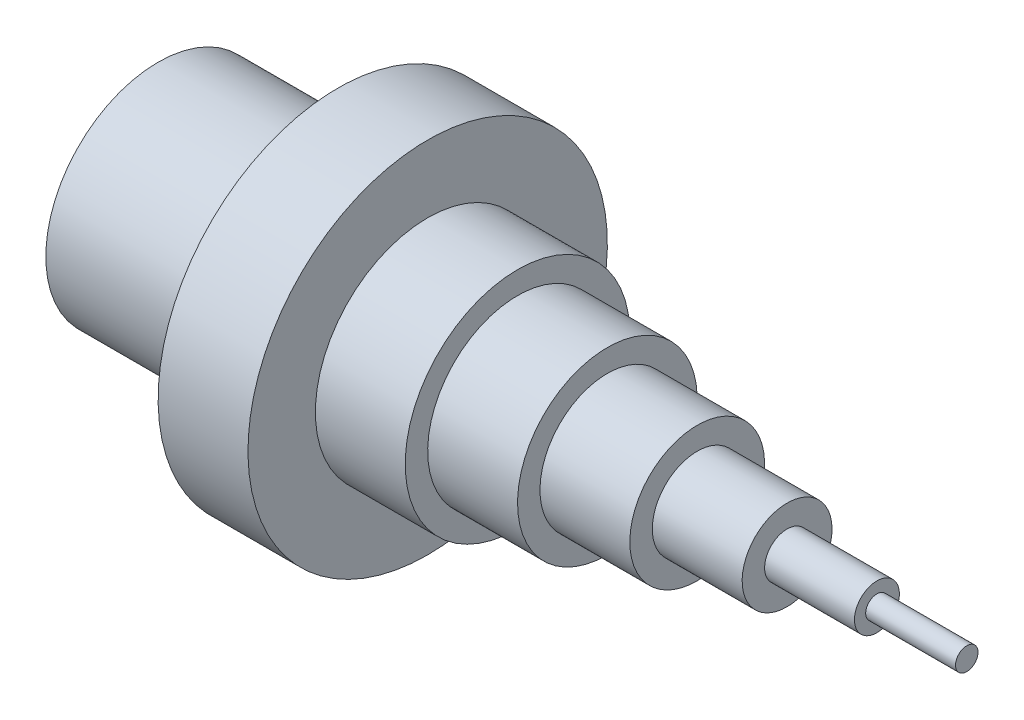
ISO-10303-21;
HEADER;
FILE_DESCRIPTION(('STEP AP214'),'2;1');
FILE_NAME('part.step','',(''),(''),'','','');
FILE_SCHEMA(('AUTOMOTIVE_DESIGN { 1 0 10303 214 1 1 1 1 }'));
ENDSEC;
DATA;
#1=APPLICATION_CONTEXT('core data for automotive mechanical design processes');
#2=APPLICATION_PROTOCOL_DEFINITION('international standard','automotive_design',2000,#1);
#3=PRODUCT_CONTEXT('',#1,'mechanical');
#4=PRODUCT('Part','Part','',(#3));
#5=PRODUCT_RELATED_PRODUCT_CATEGORY('part','',(#4));
#6=PRODUCT_DEFINITION_FORMATION('','',#4);
#7=PRODUCT_DEFINITION_CONTEXT('part definition',#1,'design');
#8=PRODUCT_DEFINITION('design','',#6,#7);
#9=PRODUCT_DEFINITION_SHAPE('','',#8);
#10=(LENGTH_UNIT() NAMED_UNIT(*) SI_UNIT(.MILLI.,.METRE.));
#11=(NAMED_UNIT(*) PLANE_ANGLE_UNIT() SI_UNIT($,.RADIAN.));
#12=(NAMED_UNIT(*) SI_UNIT($,.STERADIAN.) SOLID_ANGLE_UNIT());
#13=UNCERTAINTY_MEASURE_WITH_UNIT(LENGTH_MEASURE(1.E-05),#10,'distance_accuracy_value','');
#14=(GEOMETRIC_REPRESENTATION_CONTEXT(3) GLOBAL_UNCERTAINTY_ASSIGNED_CONTEXT((#13)) GLOBAL_UNIT_ASSIGNED_CONTEXT((#10,
#11,#12)) REPRESENTATION_CONTEXT('',''));
#15=CARTESIAN_POINT('',(0.,0.,0.));
#16=DIRECTION('',(0.,0.,1.));
#17=DIRECTION('',(1.,0.,0.));
#18=AXIS2_PLACEMENT_3D('',#15,#16,#17);
#19=CARTESIAN_POINT('',(0.,0.,0.));
#20=DIRECTION('',(1.,0.,0.));
#21=DIRECTION('',(0.,1.,0.));
#22=AXIS2_PLACEMENT_3D('',#19,#20,#21);
#23=PLANE('',#22);
#24=CARTESIAN_POINT('',(0.,0.,0.));
#25=DIRECTION('',(-1.,0.,0.));
#26=DIRECTION('',(0.,-1.,0.));
#27=AXIS2_PLACEMENT_3D('',#24,#25,#26);
#28=CIRCLE('',#27,20.);
#29=CARTESIAN_POINT('',(0.,-20.,0.));
#30=VERTEX_POINT('',#29);
#31=EDGE_CURVE('E88',#30,#30,#28,.T.);
#32=ORIENTED_EDGE('',*,*,#31,.F.);
#33=EDGE_LOOP('',(#32));
#34=FACE_BOUND('',#33,.T.);
#35=CARTESIAN_POINT('',(0.,0.,0.));
#36=DIRECTION('',(-1.,0.,0.));
#37=DIRECTION('',(0.,-1.,0.));
#38=AXIS2_PLACEMENT_3D('',#35,#36,#37);
#39=CIRCLE('',#38,25.0000000000001);
#40=CARTESIAN_POINT('',(0.,-25.0000000000001,0.));
#41=VERTEX_POINT('',#40);
#42=EDGE_CURVE('E10',#41,#41,#39,.T.);
#43=ORIENTED_EDGE('',*,*,#42,.T.);
#44=EDGE_LOOP('',(#43));
#45=FACE_BOUND('',#44,.T.);
#46=ADVANCED_FACE('F30',(#34,#45),#23,.F.);
#47=CARTESIAN_POINT('',(-272.648237515016,-1.00151248915236E-13,0.));
#48=DIRECTION('',(-1.,0.,0.));
#49=DIRECTION('',(0.,-1.,0.));
#50=AXIS2_PLACEMENT_3D('',#47,#48,#49);
#51=CYLINDRICAL_SURFACE('',#50,25.);
#52=ORIENTED_EDGE('',*,*,#42,.F.);
#53=EDGE_LOOP('',(#52));
#54=FACE_BOUND('',#53,.T.);
#55=CARTESIAN_POINT('',(40.,0.,0.));
#56=DIRECTION('',(-1.,0.,0.));
#57=DIRECTION('',(0.,-1.,0.));
#58=AXIS2_PLACEMENT_3D('',#55,#56,#57);
#59=CIRCLE('',#58,25.);
#60=CARTESIAN_POINT('',(40.,-25.0000000000001,0.));
#61=VERTEX_POINT('',#60);
#62=EDGE_CURVE('E36',#61,#61,#59,.T.);
#63=ORIENTED_EDGE('',*,*,#62,.T.);
#64=EDGE_LOOP('',(#63));
#65=FACE_BOUND('',#64,.T.);
#66=ADVANCED_FACE('F96',(#54,#65),#51,.T.);
#67=CARTESIAN_POINT('',(40.,25.,0.));
#68=DIRECTION('',(1.,0.,0.));
#69=DIRECTION('',(0.,1.,0.));
#70=AXIS2_PLACEMENT_3D('',#67,#68,#69);
#71=PLANE('',#70);
#72=ORIENTED_EDGE('',*,*,#62,.F.);
#73=EDGE_LOOP('',(#72));
#74=FACE_BOUND('',#73,.T.);
#75=CARTESIAN_POINT('',(40.,0.,0.));
#76=DIRECTION('',(-1.,0.,0.));
#77=DIRECTION('',(0.,-1.,0.));
#78=AXIS2_PLACEMENT_3D('',#75,#76,#77);
#79=CIRCLE('',#78,40.);
#80=CARTESIAN_POINT('',(40.,-40.0000000000001,0.));
#81=VERTEX_POINT('',#80);
#82=EDGE_CURVE('E40',#81,#81,#79,.T.);
#83=ORIENTED_EDGE('',*,*,#82,.T.);
#84=EDGE_LOOP('',(#83));
#85=FACE_BOUND('',#84,.T.);
#86=ADVANCED_FACE('F100',(#74,#85),#71,.F.);
#87=CARTESIAN_POINT('',(-272.648237515016,-1.00151248915236E-13,0.));
#88=DIRECTION('',(-1.,0.,0.));
#89=DIRECTION('',(0.,-1.,0.));
#90=AXIS2_PLACEMENT_3D('',#87,#88,#89);
#91=CYLINDRICAL_SURFACE('',#90,40.);
#92=ORIENTED_EDGE('',*,*,#82,.F.);
#93=EDGE_LOOP('',(#92));
#94=FACE_BOUND('',#93,.T.);
#95=CARTESIAN_POINT('',(59.9999999999999,0.,0.));
#96=DIRECTION('',(-1.,0.,0.));
#97=DIRECTION('',(0.,-1.,0.));
#98=AXIS2_PLACEMENT_3D('',#95,#96,#97);
#99=CIRCLE('',#98,40.);
#100=CARTESIAN_POINT('',(60.,-40.0000000000001,0.));
#101=VERTEX_POINT('',#100);
#102=EDGE_CURVE('E44',#101,#101,#99,.T.);
#103=ORIENTED_EDGE('',*,*,#102,.T.);
#104=EDGE_LOOP('',(#103));
#105=FACE_BOUND('',#104,.T.);
#106=ADVANCED_FACE('F105',(#94,#105),#91,.T.);
#107=CARTESIAN_POINT('',(59.9999999999999,40.,0.));
#108=DIRECTION('',(-1.,0.,0.));
#109=DIRECTION('',(0.,-1.,0.));
#110=AXIS2_PLACEMENT_3D('',#107,#108,#109);
#111=PLANE('',#110);
#112=ORIENTED_EDGE('',*,*,#102,.F.);
#113=EDGE_LOOP('',(#112));
#114=FACE_BOUND('',#113,.T.);
#115=CARTESIAN_POINT('',(59.9999999999999,0.,0.));
#116=DIRECTION('',(-1.,0.,0.));
#117=DIRECTION('',(0.,-1.,0.));
#118=AXIS2_PLACEMENT_3D('',#115,#116,#117);
#119=CIRCLE('',#118,25.);
#120=CARTESIAN_POINT('',(59.9999999999999,-25.0000000000001,0.));
#121=VERTEX_POINT('',#120);
#122=EDGE_CURVE('E49',#121,#121,#119,.T.);
#123=ORIENTED_EDGE('',*,*,#122,.T.);
#124=EDGE_LOOP('',(#123));
#125=FACE_BOUND('',#124,.T.);
#126=ADVANCED_FACE('F111',(#114,#125),#111,.F.);
#127=CARTESIAN_POINT('',(-272.648237515016,-1.00151248915236E-13,0.));
#128=DIRECTION('',(-1.,0.,0.));
#129=DIRECTION('',(0.,-1.,0.));
#130=AXIS2_PLACEMENT_3D('',#127,#128,#129);
#131=CYLINDRICAL_SURFACE('',#130,25.);
#132=ORIENTED_EDGE('',*,*,#122,.F.);
#133=EDGE_LOOP('',(#132));
#134=FACE_BOUND('',#133,.T.);
#135=CARTESIAN_POINT('',(79.9999999999999,0.,0.));
#136=DIRECTION('',(-1.,0.,0.));
#137=DIRECTION('',(0.,-1.,0.));
#138=AXIS2_PLACEMENT_3D('',#135,#136,#137);
#139=CIRCLE('',#138,25.);
#140=CARTESIAN_POINT('',(79.9999999999999,-25.0000000000001,0.));
#141=VERTEX_POINT('',#140);
#142=EDGE_CURVE('E52',#141,#141,#139,.T.);
#143=ORIENTED_EDGE('',*,*,#142,.T.);
#144=EDGE_LOOP('',(#143));
#145=FACE_BOUND('',#144,.T.);
#146=ADVANCED_FACE('F115',(#134,#145),#131,.T.);
#147=CARTESIAN_POINT('',(79.9999999999999,25.,0.));
#148=DIRECTION('',(-1.,0.,0.));
#149=DIRECTION('',(0.,-1.,0.));
#150=AXIS2_PLACEMENT_3D('',#147,#148,#149);
#151=PLANE('',#150);
#152=ORIENTED_EDGE('',*,*,#142,.F.);
#153=EDGE_LOOP('',(#152));
#154=FACE_BOUND('',#153,.T.);
#155=CARTESIAN_POINT('',(79.9999999999999,0.,0.));
#156=DIRECTION('',(-1.,0.,0.));
#157=DIRECTION('',(0.,-1.,0.));
#158=AXIS2_PLACEMENT_3D('',#155,#156,#157);
#159=CIRCLE('',#158,20.);
#160=CARTESIAN_POINT('',(79.9999999999999,-20.0000000000001,0.));
#161=VERTEX_POINT('',#160);
#162=EDGE_CURVE('E55',#161,#161,#159,.T.);
#163=ORIENTED_EDGE('',*,*,#162,.T.);
#164=EDGE_LOOP('',(#163));
#165=FACE_BOUND('',#164,.T.);
#166=ADVANCED_FACE('F119',(#154,#165),#151,.F.);
#167=CARTESIAN_POINT('',(-272.648237515016,-1.00151248915236E-13,0.));
#168=DIRECTION('',(-1.,0.,0.));
#169=DIRECTION('',(0.,-1.,0.));
#170=AXIS2_PLACEMENT_3D('',#167,#168,#169);
#171=CYLINDRICAL_SURFACE('',#170,20.);
#172=ORIENTED_EDGE('',*,*,#162,.F.);
#173=EDGE_LOOP('',(#172));
#174=FACE_BOUND('',#173,.T.);
#175=CARTESIAN_POINT('',(99.9999999999999,0.,0.));
#176=DIRECTION('',(-1.,0.,0.));
#177=DIRECTION('',(0.,-1.,0.));
#178=AXIS2_PLACEMENT_3D('',#175,#176,#177);
#179=CIRCLE('',#178,20.);
#180=CARTESIAN_POINT('',(99.9999999999999,-20.0000000000001,0.));
#181=VERTEX_POINT('',#180);
#182=EDGE_CURVE('E58',#181,#181,#179,.T.);
#183=ORIENTED_EDGE('',*,*,#182,.T.);
#184=EDGE_LOOP('',(#183));
#185=FACE_BOUND('',#184,.T.);
#186=ADVANCED_FACE('F123',(#174,#185),#171,.T.);
#187=CARTESIAN_POINT('',(99.9999999999999,20.,0.));
#188=DIRECTION('',(-1.,0.,0.));
#189=DIRECTION('',(0.,-1.,0.));
#190=AXIS2_PLACEMENT_3D('',#187,#188,#189);
#191=PLANE('',#190);
#192=ORIENTED_EDGE('',*,*,#182,.F.);
#193=EDGE_LOOP('',(#192));
#194=FACE_BOUND('',#193,.T.);
#195=CARTESIAN_POINT('',(99.9999999999999,0.,0.));
#196=DIRECTION('',(-1.,0.,0.));
#197=DIRECTION('',(0.,-1.,0.));
#198=AXIS2_PLACEMENT_3D('',#195,#196,#197);
#199=CIRCLE('',#198,15.);
#200=CARTESIAN_POINT('',(99.9999999999999,-15.0000000000001,0.));
#201=VERTEX_POINT('',#200);
#202=EDGE_CURVE('E61',#201,#201,#199,.T.);
#203=ORIENTED_EDGE('',*,*,#202,.T.);
#204=EDGE_LOOP('',(#203));
#205=FACE_BOUND('',#204,.T.);
#206=ADVANCED_FACE('F127',(#194,#205),#191,.F.);
#207=CARTESIAN_POINT('',(-272.648237515016,-1.00151248915236E-13,0.));
#208=DIRECTION('',(-1.,0.,0.));
#209=DIRECTION('',(0.,-1.,0.));
#210=AXIS2_PLACEMENT_3D('',#207,#208,#209);
#211=CYLINDRICAL_SURFACE('',#210,15.);
#212=ORIENTED_EDGE('',*,*,#202,.F.);
#213=EDGE_LOOP('',(#212));
#214=FACE_BOUND('',#213,.T.);
#215=CARTESIAN_POINT('',(120.,0.,0.));
#216=DIRECTION('',(-1.,0.,0.));
#217=DIRECTION('',(0.,-1.,0.));
#218=AXIS2_PLACEMENT_3D('',#215,#216,#217);
#219=CIRCLE('',#218,15.);
#220=CARTESIAN_POINT('',(120.,-15.0000000000001,0.));
#221=VERTEX_POINT('',#220);
#222=EDGE_CURVE('E64',#221,#221,#219,.T.);
#223=ORIENTED_EDGE('',*,*,#222,.T.);
#224=EDGE_LOOP('',(#223));
#225=FACE_BOUND('',#224,.T.);
#226=ADVANCED_FACE('F131',(#214,#225),#211,.T.);
#227=CARTESIAN_POINT('',(120.,15.,0.));
#228=DIRECTION('',(-1.,0.,0.));
#229=DIRECTION('',(0.,-1.,0.));
#230=AXIS2_PLACEMENT_3D('',#227,#228,#229);
#231=PLANE('',#230);
#232=ORIENTED_EDGE('',*,*,#222,.F.);
#233=EDGE_LOOP('',(#232));
#234=FACE_BOUND('',#233,.T.);
#235=CARTESIAN_POINT('',(120.,0.,0.));
#236=DIRECTION('',(-1.,0.,0.));
#237=DIRECTION('',(0.,-1.,0.));
#238=AXIS2_PLACEMENT_3D('',#235,#236,#237);
#239=CIRCLE('',#238,10.);
#240=CARTESIAN_POINT('',(120.,-10.0000000000001,0.));
#241=VERTEX_POINT('',#240);
#242=EDGE_CURVE('E67',#241,#241,#239,.T.);
#243=ORIENTED_EDGE('',*,*,#242,.T.);
#244=EDGE_LOOP('',(#243));
#245=FACE_BOUND('',#244,.T.);
#246=ADVANCED_FACE('F135',(#234,#245),#231,.F.);
#247=CARTESIAN_POINT('',(-272.648237515016,-1.00151248915236E-13,0.));
#248=DIRECTION('',(-1.,0.,0.));
#249=DIRECTION('',(0.,-1.,0.));
#250=AXIS2_PLACEMENT_3D('',#247,#248,#249);
#251=CYLINDRICAL_SURFACE('',#250,10.);
#252=ORIENTED_EDGE('',*,*,#242,.F.);
#253=EDGE_LOOP('',(#252));
#254=FACE_BOUND('',#253,.T.);
#255=CARTESIAN_POINT('',(140.,0.,0.));
#256=DIRECTION('',(-1.,0.,0.));
#257=DIRECTION('',(0.,-1.,0.));
#258=AXIS2_PLACEMENT_3D('',#255,#256,#257);
#259=CIRCLE('',#258,10.);
#260=CARTESIAN_POINT('',(140.,-10.,0.));
#261=VERTEX_POINT('',#260);
#262=EDGE_CURVE('E70',#261,#261,#259,.T.);
#263=ORIENTED_EDGE('',*,*,#262,.T.);
#264=EDGE_LOOP('',(#263));
#265=FACE_BOUND('',#264,.T.);
#266=ADVANCED_FACE('F139',(#254,#265),#251,.T.);
#267=CARTESIAN_POINT('',(140.,10.,0.));
#268=DIRECTION('',(-1.,0.,0.));
#269=DIRECTION('',(0.,-1.,0.));
#270=AXIS2_PLACEMENT_3D('',#267,#268,#269);
#271=PLANE('',#270);
#272=ORIENTED_EDGE('',*,*,#262,.F.);
#273=EDGE_LOOP('',(#272));
#274=FACE_BOUND('',#273,.T.);
#275=CARTESIAN_POINT('',(140.,0.,0.));
#276=DIRECTION('',(-1.,0.,0.));
#277=DIRECTION('',(0.,-1.,0.));
#278=AXIS2_PLACEMENT_3D('',#275,#276,#277);
#279=CIRCLE('',#278,5.00000000000002);
#280=CARTESIAN_POINT('',(140.,-5.00000000000005,0.));
#281=VERTEX_POINT('',#280);
#282=EDGE_CURVE('E73',#281,#281,#279,.T.);
#283=ORIENTED_EDGE('',*,*,#282,.T.);
#284=EDGE_LOOP('',(#283));
#285=FACE_BOUND('',#284,.T.);
#286=ADVANCED_FACE('F143',(#274,#285),#271,.F.);
#287=CARTESIAN_POINT('',(-272.648237515016,-1.00151248915236E-13,0.));
#288=DIRECTION('',(-1.,0.,0.));
#289=DIRECTION('',(0.,-1.,0.));
#290=AXIS2_PLACEMENT_3D('',#287,#288,#289);
#291=CYLINDRICAL_SURFACE('',#290,5.00000000000002);
#292=ORIENTED_EDGE('',*,*,#282,.F.);
#293=EDGE_LOOP('',(#292));
#294=FACE_BOUND('',#293,.T.);
#295=CARTESIAN_POINT('',(160.,0.,0.));
#296=DIRECTION('',(-1.,0.,0.));
#297=DIRECTION('',(0.,-1.,0.));
#298=AXIS2_PLACEMENT_3D('',#295,#296,#297);
#299=CIRCLE('',#298,5.00000000000002);
#300=CARTESIAN_POINT('',(160.,-5.00000000000004,0.));
#301=VERTEX_POINT('',#300);
#302=EDGE_CURVE('E76',#301,#301,#299,.T.);
#303=ORIENTED_EDGE('',*,*,#302,.T.);
#304=EDGE_LOOP('',(#303));
#305=FACE_BOUND('',#304,.T.);
#306=ADVANCED_FACE('F147',(#294,#305),#291,.T.);
#307=CARTESIAN_POINT('',(160.,5.,0.));
#308=DIRECTION('',(-1.,0.,0.));
#309=DIRECTION('',(0.,-1.,0.));
#310=AXIS2_PLACEMENT_3D('',#307,#308,#309);
#311=PLANE('',#310);
#312=ORIENTED_EDGE('',*,*,#302,.F.);
#313=EDGE_LOOP('',(#312));
#314=FACE_BOUND('',#313,.T.);
#315=CARTESIAN_POINT('',(160.,0.,0.));
#316=DIRECTION('',(-1.,0.,0.));
#317=DIRECTION('',(0.,-1.,0.));
#318=AXIS2_PLACEMENT_3D('',#315,#316,#317);
#319=CIRCLE('',#318,2.50000000000002);
#320=CARTESIAN_POINT('',(160.,-2.50000000000004,0.));
#321=VERTEX_POINT('',#320);
#322=EDGE_CURVE('E79',#321,#321,#319,.T.);
#323=ORIENTED_EDGE('',*,*,#322,.T.);
#324=EDGE_LOOP('',(#323));
#325=FACE_BOUND('',#324,.T.);
#326=ADVANCED_FACE('F151',(#314,#325),#311,.F.);
#327=CARTESIAN_POINT('',(-272.648237515016,-1.00151248915236E-13,0.));
#328=DIRECTION('',(-1.,0.,0.));
#329=DIRECTION('',(0.,-1.,0.));
#330=AXIS2_PLACEMENT_3D('',#327,#328,#329);
#331=CYLINDRICAL_SURFACE('',#330,2.50000000000002);
#332=ORIENTED_EDGE('',*,*,#322,.F.);
#333=EDGE_LOOP('',(#332));
#334=FACE_BOUND('',#333,.T.);
#335=CARTESIAN_POINT('',(180.,0.,0.));
#336=DIRECTION('',(-1.,0.,0.));
#337=DIRECTION('',(0.,-1.,0.));
#338=AXIS2_PLACEMENT_3D('',#335,#336,#337);
#339=CIRCLE('',#338,2.50000000000002);
#340=CARTESIAN_POINT('',(180.,-2.50000000000003,0.));
#341=VERTEX_POINT('',#340);
#342=EDGE_CURVE('E82',#341,#341,#339,.T.);
#343=ORIENTED_EDGE('',*,*,#342,.T.);
#344=EDGE_LOOP('',(#343));
#345=FACE_BOUND('',#344,.T.);
#346=ADVANCED_FACE('F155',(#334,#345),#331,.T.);
#347=CARTESIAN_POINT('',(180.,2.5,0.));
#348=DIRECTION('',(-1.,0.,0.));
#349=DIRECTION('',(0.,-1.,0.));
#350=AXIS2_PLACEMENT_3D('',#347,#348,#349);
#351=PLANE('',#350);
#352=ORIENTED_EDGE('',*,*,#342,.F.);
#353=EDGE_LOOP('',(#352));
#354=FACE_BOUND('',#353,.T.);
#355=ADVANCED_FACE('F159',(#354),#351,.F.);
#356=CARTESIAN_POINT('',(40.,25.,0.));
#357=DIRECTION('',(1.,0.,0.));
#358=DIRECTION('',(0.,1.,0.));
#359=AXIS2_PLACEMENT_3D('',#356,#357,#358);
#360=PLANE('',#359);
#361=CARTESIAN_POINT('',(40.,0.,0.));
#362=DIRECTION('',(1.,0.,0.));
#363=DIRECTION('',(0.,1.,0.));
#364=AXIS2_PLACEMENT_3D('',#361,#362,#363);
#365=CIRCLE('',#364,20.);
#366=CARTESIAN_POINT('',(40.,20.,0.));
#367=VERTEX_POINT('',#366);
#368=EDGE_CURVE('E85',#367,#367,#365,.F.);
#369=ORIENTED_EDGE('',*,*,#368,.T.);
#370=EDGE_LOOP('',(#369));
#371=FACE_BOUND('',#370,.T.);
#372=ADVANCED_FACE('F163',(#371),#360,.F.);
#373=CARTESIAN_POINT('',(96.5685424949238,0.,0.));
#374=DIRECTION('',(-1.,0.,0.));
#375=DIRECTION('',(0.,-1.,0.));
#376=AXIS2_PLACEMENT_3D('',#373,#374,#375);
#377=CYLINDRICAL_SURFACE('',#376,20.);
#378=ORIENTED_EDGE('',*,*,#31,.T.);
#379=EDGE_LOOP('',(#378));
#380=FACE_BOUND('',#379,.T.);
#381=ORIENTED_EDGE('',*,*,#368,.F.);
#382=EDGE_LOOP('',(#381));
#383=FACE_BOUND('',#382,.T.);
#384=ADVANCED_FACE('F92',(#380,#383),#377,.F.);
#385=CLOSED_SHELL('',(#46,#66,#86,#106,#126,#146,#166,#186,#206,#226,#246,#266,#286,#306,#326,
#346,#355,#372,#384));
#386=MANIFOLD_SOLID_BREP('B2',#385);
#387=ADVANCED_BREP_SHAPE_REPRESENTATION('',(#18,#386),#14);
#388=SHAPE_DEFINITION_REPRESENTATION(#9,#387);
ENDSEC;
END-ISO-10303-21;
